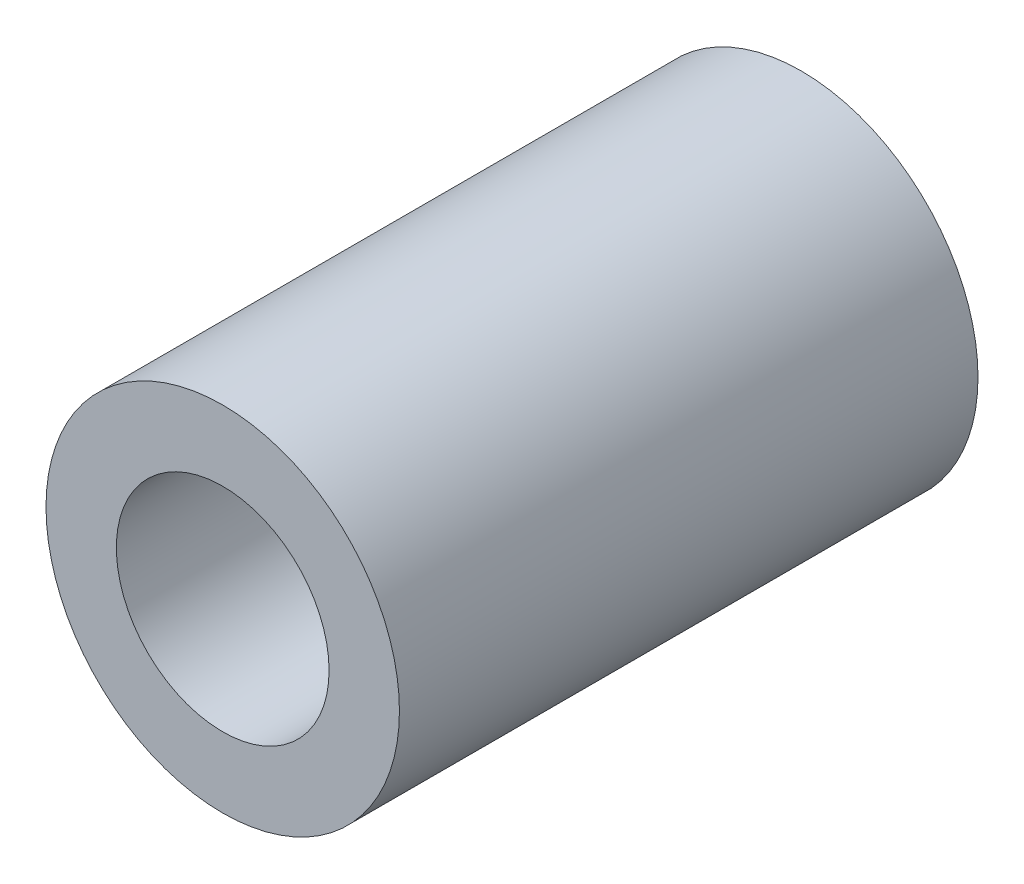
ISO-10303-21;
HEADER;
FILE_DESCRIPTION(('STEP AP214'),'2;1');
FILE_NAME('part.step','',(''),(''),'','','');
FILE_SCHEMA(('AUTOMOTIVE_DESIGN { 1 0 10303 214 1 1 1 1 }'));
ENDSEC;
DATA;
#1=APPLICATION_CONTEXT('core data for automotive mechanical design processes');
#2=APPLICATION_PROTOCOL_DEFINITION('international standard','automotive_design',2000,#1);
#3=PRODUCT_CONTEXT('',#1,'mechanical');
#4=PRODUCT('Part','Part','',(#3));
#5=PRODUCT_RELATED_PRODUCT_CATEGORY('part','',(#4));
#6=PRODUCT_DEFINITION_FORMATION('','',#4);
#7=PRODUCT_DEFINITION_CONTEXT('part definition',#1,'design');
#8=PRODUCT_DEFINITION('design','',#6,#7);
#9=PRODUCT_DEFINITION_SHAPE('','',#8);
#10=(LENGTH_UNIT() NAMED_UNIT(*) SI_UNIT(.MILLI.,.METRE.));
#11=(NAMED_UNIT(*) PLANE_ANGLE_UNIT() SI_UNIT($,.RADIAN.));
#12=(NAMED_UNIT(*) SI_UNIT($,.STERADIAN.) SOLID_ANGLE_UNIT());
#13=UNCERTAINTY_MEASURE_WITH_UNIT(LENGTH_MEASURE(1.E-05),#10,'distance_accuracy_value','');
#14=(GEOMETRIC_REPRESENTATION_CONTEXT(3) GLOBAL_UNCERTAINTY_ASSIGNED_CONTEXT((#13)) GLOBAL_UNIT_ASSIGNED_CONTEXT((#10,
#11,#12)) REPRESENTATION_CONTEXT('',''));
#15=CARTESIAN_POINT('',(0.,0.,0.));
#16=DIRECTION('',(0.,0.,1.));
#17=DIRECTION('',(1.,0.,0.));
#18=AXIS2_PLACEMENT_3D('',#15,#16,#17);
#19=CARTESIAN_POINT('',(0.,0.,26.1112));
#20=DIRECTION('',(0.,0.,1.));
#21=DIRECTION('',(1.,0.,0.));
#22=AXIS2_PLACEMENT_3D('',#19,#20,#21);
#23=PLANE('',#22);
#24=CARTESIAN_POINT('',(0.,0.,26.1112));
#25=DIRECTION('',(0.,0.,1.));
#26=DIRECTION('',(1.,0.,0.));
#27=AXIS2_PLACEMENT_3D('',#24,#25,#26);
#28=CIRCLE('',#27,7.9756);
#29=CARTESIAN_POINT('',(7.9756,0.,26.1112));
#30=VERTEX_POINT('',#29);
#31=EDGE_CURVE('E10',#30,#30,#28,.T.);
#32=ORIENTED_EDGE('',*,*,#31,.T.);
#33=EDGE_LOOP('',(#32));
#34=FACE_BOUND('',#33,.T.);
#35=CARTESIAN_POINT('',(0.,0.,26.1112));
#36=DIRECTION('',(0.,0.,1.));
#37=DIRECTION('',(1.,0.,0.));
#38=AXIS2_PLACEMENT_3D('',#35,#36,#37);
#39=CIRCLE('',#38,4.8006);
#40=CARTESIAN_POINT('',(4.8006,0.,26.1112));
#41=VERTEX_POINT('',#40);
#42=EDGE_CURVE('E46',#41,#41,#39,.T.);
#43=ORIENTED_EDGE('',*,*,#42,.F.);
#44=EDGE_LOOP('',(#43));
#45=FACE_BOUND('',#44,.T.);
#46=ADVANCED_FACE('F32',(#34,#45),#23,.T.);
#47=CARTESIAN_POINT('',(0.,0.,0.));
#48=DIRECTION('',(0.,0.,1.));
#49=DIRECTION('',(1.,0.,0.));
#50=AXIS2_PLACEMENT_3D('',#47,#48,#49);
#51=PLANE('',#50);
#52=CARTESIAN_POINT('',(0.,0.,0.));
#53=DIRECTION('',(0.,0.,1.));
#54=DIRECTION('',(1.,0.,0.));
#55=AXIS2_PLACEMENT_3D('',#52,#53,#54);
#56=CIRCLE('',#55,7.9756);
#57=CARTESIAN_POINT('',(7.9756,0.,0.));
#58=VERTEX_POINT('',#57);
#59=EDGE_CURVE('E36',#58,#58,#56,.T.);
#60=ORIENTED_EDGE('',*,*,#59,.F.);
#61=EDGE_LOOP('',(#60));
#62=FACE_BOUND('',#61,.T.);
#63=CARTESIAN_POINT('',(0.,0.,0.));
#64=DIRECTION('',(0.,0.,1.));
#65=DIRECTION('',(1.,0.,0.));
#66=AXIS2_PLACEMENT_3D('',#63,#64,#65);
#67=CIRCLE('',#66,4.8006);
#68=CARTESIAN_POINT('',(4.8006,0.,0.));
#69=VERTEX_POINT('',#68);
#70=EDGE_CURVE('E48',#69,#69,#67,.T.);
#71=ORIENTED_EDGE('',*,*,#70,.T.);
#72=EDGE_LOOP('',(#71));
#73=FACE_BOUND('',#72,.T.);
#74=ADVANCED_FACE('F61',(#62,#73),#51,.F.);
#75=CARTESIAN_POINT('',(0.,0.,26.1112));
#76=DIRECTION('',(0.,0.,-1.));
#77=DIRECTION('',(-1.,0.,0.));
#78=AXIS2_PLACEMENT_3D('',#75,#76,#77);
#79=CYLINDRICAL_SURFACE('',#78,7.9756);
#80=ORIENTED_EDGE('',*,*,#31,.F.);
#81=EDGE_LOOP('',(#80));
#82=FACE_BOUND('',#81,.T.);
#83=ORIENTED_EDGE('',*,*,#59,.T.);
#84=EDGE_LOOP('',(#83));
#85=FACE_BOUND('',#84,.T.);
#86=ADVANCED_FACE('F34',(#82,#85),#79,.T.);
#87=CARTESIAN_POINT('',(0.,0.,26.1112));
#88=DIRECTION('',(0.,0.,-1.));
#89=DIRECTION('',(-1.,0.,0.));
#90=AXIS2_PLACEMENT_3D('',#87,#88,#89);
#91=CYLINDRICAL_SURFACE('',#90,4.8006);
#92=ORIENTED_EDGE('',*,*,#42,.T.);
#93=EDGE_LOOP('',(#92));
#94=FACE_BOUND('',#93,.T.);
#95=ORIENTED_EDGE('',*,*,#70,.F.);
#96=EDGE_LOOP('',(#95));
#97=FACE_BOUND('',#96,.T.);
#98=ADVANCED_FACE('F57',(#94,#97),#91,.F.);
#99=CLOSED_SHELL('',(#46,#74,#86,#98));
#100=MANIFOLD_SOLID_BREP('B2',#99);
#101=ADVANCED_BREP_SHAPE_REPRESENTATION('',(#18,#100),#14);
#102=SHAPE_DEFINITION_REPRESENTATION(#9,#101);
ENDSEC;
END-ISO-10303-21;
